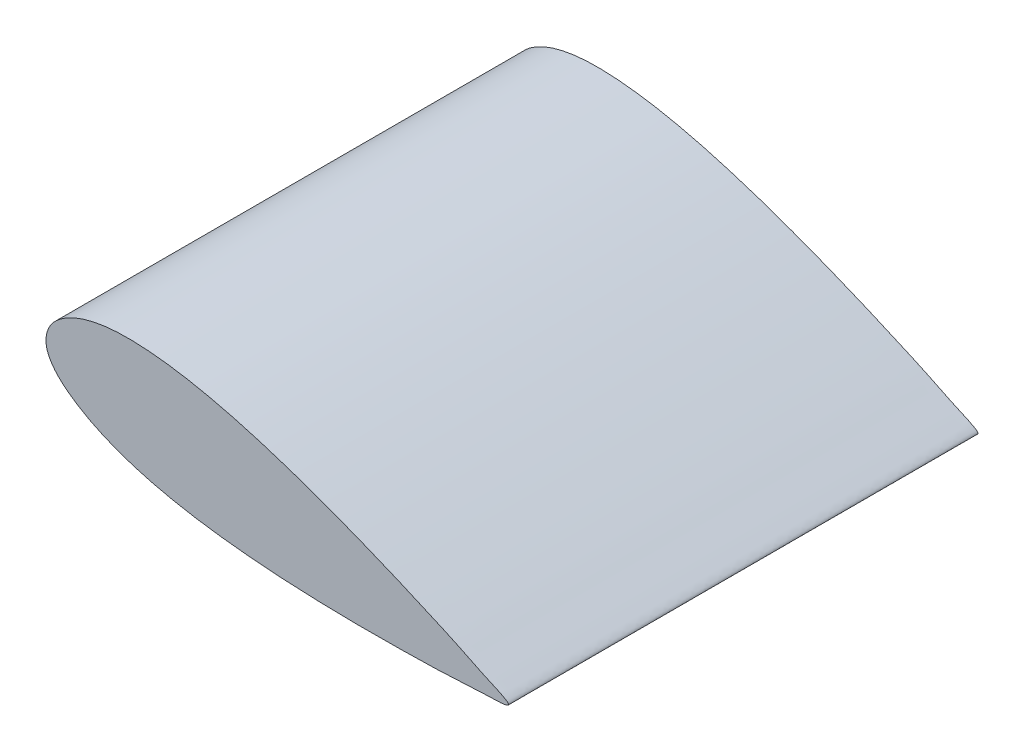
ISO-10303-21;
HEADER;
FILE_DESCRIPTION(('STEP AP214'),'2;1');
FILE_NAME('part.step','',(''),(''),'','','');
FILE_SCHEMA(('AUTOMOTIVE_DESIGN { 1 0 10303 214 1 1 1 1 }'));
ENDSEC;
DATA;
#1=APPLICATION_CONTEXT('core data for automotive mechanical design processes');
#2=APPLICATION_PROTOCOL_DEFINITION('international standard','automotive_design',2000,#1);
#3=PRODUCT_CONTEXT('',#1,'mechanical');
#4=PRODUCT('Part','Part','',(#3));
#5=PRODUCT_RELATED_PRODUCT_CATEGORY('part','',(#4));
#6=PRODUCT_DEFINITION_FORMATION('','',#4);
#7=PRODUCT_DEFINITION_CONTEXT('part definition',#1,'design');
#8=PRODUCT_DEFINITION('design','',#6,#7);
#9=PRODUCT_DEFINITION_SHAPE('','',#8);
#10=(LENGTH_UNIT() NAMED_UNIT(*) SI_UNIT(.MILLI.,.METRE.));
#11=(NAMED_UNIT(*) PLANE_ANGLE_UNIT() SI_UNIT($,.RADIAN.));
#12=(NAMED_UNIT(*) SI_UNIT($,.STERADIAN.) SOLID_ANGLE_UNIT());
#13=UNCERTAINTY_MEASURE_WITH_UNIT(LENGTH_MEASURE(1.E-05),#10,'distance_accuracy_value','');
#14=(GEOMETRIC_REPRESENTATION_CONTEXT(3) GLOBAL_UNCERTAINTY_ASSIGNED_CONTEXT((#13)) GLOBAL_UNIT_ASSIGNED_CONTEXT((#10,
#11,#12)) REPRESENTATION_CONTEXT('',''));
#15=CARTESIAN_POINT('',(0.,0.,0.));
#16=DIRECTION('',(0.,0.,1.));
#17=DIRECTION('',(1.,0.,0.));
#18=AXIS2_PLACEMENT_3D('',#15,#16,#17);
#19=CARTESIAN_POINT('',(492.403876506104,-86.8240888334653,500.));
#20=CARTESIAN_POINT('',(492.954183925438,-84.056739130739,500.));
#21=CARTESIAN_POINT('',(466.167050611757,-73.0203947111105,500.));
#22=CARTESIAN_POINT('',(440.495419799768,-59.7027501105846,500.));
#23=CARTESIAN_POINT('',(398.94476494622,-41.2005333719707,500.));
#24=CARTESIAN_POINT('',(352.759831894711,-21.4646510601616,500.));
#25=CARTESIAN_POINT('',(305.26135951702,-2.75445616569599,500.));
#26=CARTESIAN_POINT('',(257.718655374666,14.2542931326676,500.));
#27=CARTESIAN_POINT('',(209.655239797132,29.1660878067332,500.));
#28=CARTESIAN_POINT('',(169.045923454648,39.1548927415792,500.));
#29=CARTESIAN_POINT('',(136.15427525875,44.9566578359268,500.));
#30=CARTESIAN_POINT('',(110.776924632892,47.9281883148694,500.));
#31=CARTESIAN_POINT('',(83.9682218850325,49.2125268134039,500.));
#32=CARTESIAN_POINT('',(60.349729441953,47.4932345539445,500.));
#33=CARTESIAN_POINT('',(40.7121115851853,43.0180274141193,500.));
#34=CARTESIAN_POINT('',(25.4275849843375,37.2245278592369,500.));
#35=CARTESIAN_POINT('',(12.9820067106848,29.2598935386007,500.));
#36=CARTESIAN_POINT('',(2.14366756291367,17.4494577347524,500.));
#37=CARTESIAN_POINT('',(-2.59619256387258,-0.323843799326212,500.));
#38=CARTESIAN_POINT('',(5.48566563750841,-15.7706769830179,500.));
#39=CARTESIAN_POINT('',(15.2523787015923,-26.3774262488511,500.));
#40=CARTESIAN_POINT('',(24.5213490210354,-33.9922036721803,500.));
#41=CARTESIAN_POINT('',(35.1194223900884,-41.0577793499203,500.));
#42=CARTESIAN_POINT('',(48.6741257624785,-48.8102470082289,500.));
#43=CARTESIAN_POINT('',(66.4115714615011,-57.081613279999,500.));
#44=CARTESIAN_POINT('',(89.0269691870852,-65.3110769060279,500.));
#45=CARTESIAN_POINT('',(112.85315306091,-72.0398442767079,500.));
#46=CARTESIAN_POINT('',(145.455392903949,-79.2867780128582,500.));
#47=CARTESIAN_POINT('',(186.789762440728,-85.621098636167,500.));
#48=CARTESIAN_POINT('',(236.896604511347,-90.2638794002811,500.));
#49=CARTESIAN_POINT('',(287.326152897674,-92.7715882865466,500.));
#50=CARTESIAN_POINT('',(338.370833108629,-93.6956289596276,500.));
#51=CARTESIAN_POINT('',(388.594513344068,-93.1488826037879,500.));
#52=CARTESIAN_POINT('',(434.062947006326,-91.9801736963489,500.));
#53=CARTESIAN_POINT('',(462.8790352583,-89.5271603201779,500.));
#54=CARTESIAN_POINT('',(491.853471045084,-89.5919315617626,500.));
#55=CARTESIAN_POINT('',(492.403876506104,-86.8240888334653,500.));
#56=B_SPLINE_CURVE_WITH_KNOTS('',3,(#19,#20,#21,#22,#23,#24,#25,#26,#27,#28,#29,#30,#31,#32,#33,
#34,#35,#36,#37,#38,#39,#40,#41,#42,#43,#44,#45,#46,#47,#48,#49,#50,#51,#52,#53,#54,#55),
.UNSPECIFIED.,.T.,.F.,(4,1,1,1,1,1,1,1,1,1,1,1,1,1,1,1,1,1,1,1,1,1,1,1,1,1,1,1,1,1,1,1,1,1,4),
(0.,0.0247514379467424,0.0490698205621767,0.0974677086925701,0.145589495274989,
0.193458262809989,0.241068689724686,0.288432169998104,0.335581782970497,0.359147001904993,
0.382782141597297,0.407744539547653,0.4349259499148,0.449379230714022,0.464530499324748,
0.480954839329701,0.490565189663964,0.509531019896831,0.528284230436779,0.53692531790991,
0.550401269911973,0.562003597010758,0.572911618146714,0.594499634267162,0.617220072343669,
0.640855961097841,0.664417997635018,0.711569740248719,0.758924088947856,0.806536475548492,
0.854407487183524,0.902531283856063,0.950929565300057,0.975244152385836,1.),.UNSPECIFIED.);
#57=DIRECTION('',(0.,0.,-1.));
#58=VECTOR('',#57,1.);
#59=SURFACE_OF_LINEAR_EXTRUSION('',#56,#58);
#60=CARTESIAN_POINT('',(492.403876506104,-86.8240888334653,500.));
#61=VERTEX_POINT('',#60);
#62=EDGE_CURVE('E11',#61,#61,#56,.T.);
#63=ORIENTED_EDGE('',*,*,#62,.F.);
#64=EDGE_LOOP('',(#63));
#65=FACE_BOUND('',#64,.T.);
#66=CARTESIAN_POINT('',(492.403876506104,-86.8240888334653,0.));
#67=CARTESIAN_POINT('',(492.954183925438,-84.056739130739,0.));
#68=CARTESIAN_POINT('',(466.167050611757,-73.0203947111105,0.));
#69=CARTESIAN_POINT('',(440.495419799768,-59.7027501105846,0.));
#70=CARTESIAN_POINT('',(398.94476494622,-41.2005333719707,0.));
#71=CARTESIAN_POINT('',(352.759831894711,-21.4646510601616,0.));
#72=CARTESIAN_POINT('',(305.26135951702,-2.75445616569599,0.));
#73=CARTESIAN_POINT('',(257.718655374666,14.2542931326676,0.));
#74=CARTESIAN_POINT('',(209.655239797132,29.1660878067332,0.));
#75=CARTESIAN_POINT('',(169.045923454648,39.1548927415792,0.));
#76=CARTESIAN_POINT('',(136.15427525875,44.9566578359268,0.));
#77=CARTESIAN_POINT('',(110.776924632892,47.9281883148694,0.));
#78=CARTESIAN_POINT('',(83.9682218850325,49.2125268134039,0.));
#79=CARTESIAN_POINT('',(60.349729441953,47.4932345539445,0.));
#80=CARTESIAN_POINT('',(40.7121115851853,43.0180274141193,0.));
#81=CARTESIAN_POINT('',(25.4275849843375,37.2245278592369,0.));
#82=CARTESIAN_POINT('',(12.9820067106848,29.2598935386007,0.));
#83=CARTESIAN_POINT('',(2.14366756291367,17.4494577347524,0.));
#84=CARTESIAN_POINT('',(-2.59619256387258,-0.323843799326212,0.));
#85=CARTESIAN_POINT('',(5.48566563750841,-15.7706769830179,0.));
#86=CARTESIAN_POINT('',(15.2523787015923,-26.3774262488511,0.));
#87=CARTESIAN_POINT('',(24.5213490210354,-33.9922036721803,0.));
#88=CARTESIAN_POINT('',(35.1194223900884,-41.0577793499203,0.));
#89=CARTESIAN_POINT('',(48.6741257624785,-48.8102470082289,0.));
#90=CARTESIAN_POINT('',(66.4115714615011,-57.081613279999,0.));
#91=CARTESIAN_POINT('',(89.0269691870852,-65.3110769060279,0.));
#92=CARTESIAN_POINT('',(112.85315306091,-72.0398442767079,0.));
#93=CARTESIAN_POINT('',(145.455392903949,-79.2867780128582,0.));
#94=CARTESIAN_POINT('',(186.789762440728,-85.621098636167,0.));
#95=CARTESIAN_POINT('',(236.896604511347,-90.2638794002811,0.));
#96=CARTESIAN_POINT('',(287.326152897674,-92.7715882865466,0.));
#97=CARTESIAN_POINT('',(338.370833108629,-93.6956289596276,0.));
#98=CARTESIAN_POINT('',(388.594513344068,-93.1488826037879,0.));
#99=CARTESIAN_POINT('',(434.062947006326,-91.9801736963489,0.));
#100=CARTESIAN_POINT('',(462.8790352583,-89.5271603201779,0.));
#101=CARTESIAN_POINT('',(491.853471045084,-89.5919315617626,0.));
#102=CARTESIAN_POINT('',(492.403876506104,-86.8240888334653,0.));
#103=B_SPLINE_CURVE_WITH_KNOTS('',3,(#66,#67,#68,#69,#70,#71,#72,#73,#74,#75,#76,#77,#78,#79,
#80,#81,#82,#83,#84,#85,#86,#87,#88,#89,#90,#91,#92,#93,#94,#95,#96,#97,#98,#99,#100,#101,#102),
.UNSPECIFIED.,.T.,.F.,(4,1,1,1,1,1,1,1,1,1,1,1,1,1,1,1,1,1,1,1,1,1,1,1,1,1,1,1,1,1,1,1,1,1,4),
(0.,0.0247514379467424,0.0490698205621767,0.0974677086925701,0.145589495274989,
0.193458262809989,0.241068689724686,0.288432169998104,0.335581782970497,0.359147001904993,
0.382782141597297,0.407744539547653,0.4349259499148,0.449379230714022,0.464530499324748,
0.480954839329701,0.490565189663964,0.509531019896831,0.528284230436779,0.53692531790991,
0.550401269911973,0.562003597010758,0.572911618146714,0.594499634267162,0.617220072343669,
0.640855961097841,0.664417997635018,0.711569740248719,0.758924088947856,0.806536475548492,
0.854407487183524,0.902531283856063,0.950929565300057,0.975244152385836,1.),.UNSPECIFIED.);
#104=CARTESIAN_POINT('',(492.403876506104,-86.8240888334653,0.));
#105=VERTEX_POINT('',#104);
#106=EDGE_CURVE('E47',#105,#105,#103,.T.);
#107=ORIENTED_EDGE('',*,*,#106,.T.);
#108=EDGE_LOOP('',(#107));
#109=FACE_BOUND('',#108,.T.);
#110=ADVANCED_FACE('F43',(#65,#109),#59,.F.);
#111=CARTESIAN_POINT('',(0.793006840051116,10.2027432358416,500.));
#112=DIRECTION('',(0.,0.,-1.));
#113=DIRECTION('',(-1.,0.,0.));
#114=AXIS2_PLACEMENT_3D('',#111,#112,#113);
#115=PLANE('',#114);
#116=ORIENTED_EDGE('',*,*,#62,.T.);
#117=EDGE_LOOP('',(#116));
#118=FACE_BOUND('',#117,.T.);
#119=ADVANCED_FACE('F72',(#118),#115,.F.);
#120=CARTESIAN_POINT('',(0.793006840051116,10.2027432358416,0.));
#121=DIRECTION('',(0.,0.,-1.));
#122=DIRECTION('',(-1.,0.,0.));
#123=AXIS2_PLACEMENT_3D('',#120,#121,#122);
#124=PLANE('',#123);
#125=ORIENTED_EDGE('',*,*,#106,.F.);
#126=EDGE_LOOP('',(#125));
#127=FACE_BOUND('',#126,.T.);
#128=ADVANCED_FACE('F70',(#127),#124,.T.);
#129=CLOSED_SHELL('',(#110,#119,#128));
#130=MANIFOLD_SOLID_BREP('B2',#129);
#131=ADVANCED_BREP_SHAPE_REPRESENTATION('',(#18,#130),#14);
#132=SHAPE_DEFINITION_REPRESENTATION(#9,#131);
ENDSEC;
END-ISO-10303-21;
